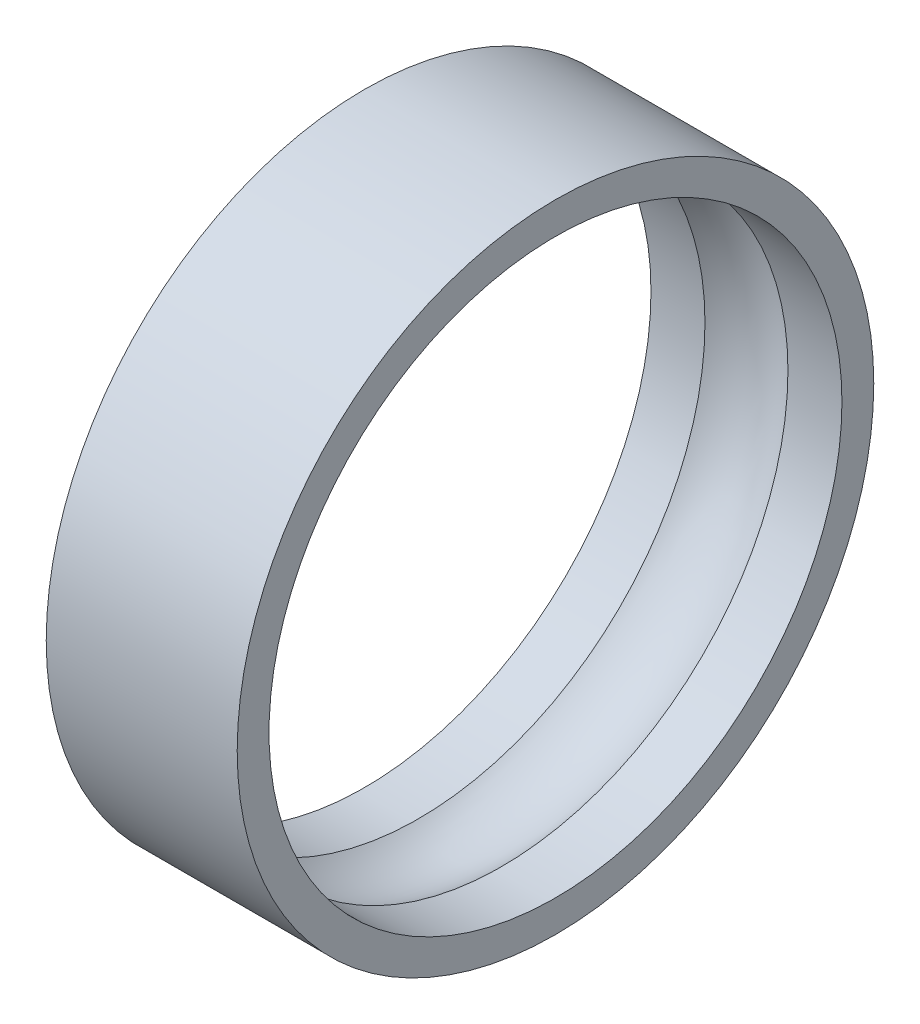
ISO-10303-21;
HEADER;
FILE_DESCRIPTION(('STEP AP214'),'2;1');
FILE_NAME('part.step','',(''),(''),'','','');
FILE_SCHEMA(('AUTOMOTIVE_DESIGN { 1 0 10303 214 1 1 1 1 }'));
ENDSEC;
DATA;
#1=APPLICATION_CONTEXT('core data for automotive mechanical design processes');
#2=APPLICATION_PROTOCOL_DEFINITION('international standard','automotive_design',2000,#1);
#3=PRODUCT_CONTEXT('',#1,'mechanical');
#4=PRODUCT('Part','Part','',(#3));
#5=PRODUCT_RELATED_PRODUCT_CATEGORY('part','',(#4));
#6=PRODUCT_DEFINITION_FORMATION('','',#4);
#7=PRODUCT_DEFINITION_CONTEXT('part definition',#1,'design');
#8=PRODUCT_DEFINITION('design','',#6,#7);
#9=PRODUCT_DEFINITION_SHAPE('','',#8);
#10=(LENGTH_UNIT() NAMED_UNIT(*) SI_UNIT(.MILLI.,.METRE.));
#11=(NAMED_UNIT(*) PLANE_ANGLE_UNIT() SI_UNIT($,.RADIAN.));
#12=(NAMED_UNIT(*) SI_UNIT($,.STERADIAN.) SOLID_ANGLE_UNIT());
#13=UNCERTAINTY_MEASURE_WITH_UNIT(LENGTH_MEASURE(1.E-05),#10,'distance_accuracy_value','');
#14=(GEOMETRIC_REPRESENTATION_CONTEXT(3) GLOBAL_UNCERTAINTY_ASSIGNED_CONTEXT((#13)) GLOBAL_UNIT_ASSIGNED_CONTEXT((#10,
#11,#12)) REPRESENTATION_CONTEXT('',''));
#15=CARTESIAN_POINT('',(0.,0.,0.));
#16=DIRECTION('',(0.,0.,1.));
#17=DIRECTION('',(1.,0.,0.));
#18=AXIS2_PLACEMENT_3D('',#15,#16,#17);
#19=CARTESIAN_POINT('',(0.,-14.25,0.));
#20=DIRECTION('',(1.,0.,0.));
#21=DIRECTION('',(0.,0.,-1.));
#22=AXIS2_PLACEMENT_3D('',#19,#20,#21);
#23=TOROIDAL_SURFACE('',#22,14.3320652805406,4.50000000000017);
#24=CARTESIAN_POINT('',(2.60696277184507,-14.25,0.));
#25=DIRECTION('',(1.,0.,0.));
#26=DIRECTION('',(0.,0.,-1.));
#27=AXIS2_PLACEMENT_3D('',#24,#25,#26);
#28=CIRCLE('',#27,18.);
#29=CARTESIAN_POINT('',(2.60696277184507,-14.25,-18.));
#30=VERTEX_POINT('',#29);
#31=EDGE_CURVE('E10',#30,#30,#28,.T.);
#32=ORIENTED_EDGE('',*,*,#31,.T.);
#33=EDGE_LOOP('',(#32));
#34=FACE_BOUND('',#33,.T.);
#35=CARTESIAN_POINT('',(-2.60696277184507,-14.25,0.));
#36=DIRECTION('',(1.,0.,0.));
#37=DIRECTION('',(0.,0.,-1.));
#38=AXIS2_PLACEMENT_3D('',#35,#36,#37);
#39=CIRCLE('',#38,18.);
#40=CARTESIAN_POINT('',(-2.60696277184507,-14.25,-18.));
#41=VERTEX_POINT('',#40);
#42=EDGE_CURVE('E64',#41,#41,#39,.T.);
#43=ORIENTED_EDGE('',*,*,#42,.F.);
#44=EDGE_LOOP('',(#43));
#45=FACE_BOUND('',#44,.T.);
#46=ADVANCED_FACE('F37',(#34,#45),#23,.F.);
#47=CARTESIAN_POINT('',(21.7151211136297,-14.25,0.));
#48=DIRECTION('',(1.,0.,0.));
#49=DIRECTION('',(0.,0.,-1.));
#50=AXIS2_PLACEMENT_3D('',#47,#48,#49);
#51=CYLINDRICAL_SURFACE('',#50,18.);
#52=CARTESIAN_POINT('',(6.,-14.25,0.));
#53=DIRECTION('',(1.,0.,0.));
#54=DIRECTION('',(0.,0.,-1.));
#55=AXIS2_PLACEMENT_3D('',#52,#53,#54);
#56=CIRCLE('',#55,18.);
#57=CARTESIAN_POINT('',(6.,-14.25,-18.));
#58=VERTEX_POINT('',#57);
#59=EDGE_CURVE('E44',#58,#58,#56,.T.);
#60=ORIENTED_EDGE('',*,*,#59,.T.);
#61=EDGE_LOOP('',(#60));
#62=FACE_BOUND('',#61,.T.);
#63=ORIENTED_EDGE('',*,*,#31,.F.);
#64=EDGE_LOOP('',(#63));
#65=FACE_BOUND('',#64,.T.);
#66=ADVANCED_FACE('F73',(#62,#65),#51,.F.);
#67=CARTESIAN_POINT('',(6.,3.75,0.));
#68=DIRECTION('',(1.,0.,0.));
#69=DIRECTION('',(0.,0.,-1.));
#70=AXIS2_PLACEMENT_3D('',#67,#68,#69);
#71=PLANE('',#70);
#72=CARTESIAN_POINT('',(6.,-14.25,0.));
#73=DIRECTION('',(1.,0.,0.));
#74=DIRECTION('',(0.,0.,-1.));
#75=AXIS2_PLACEMENT_3D('',#72,#73,#74);
#76=CIRCLE('',#75,20.);
#77=CARTESIAN_POINT('',(6.,-14.25,-20.));
#78=VERTEX_POINT('',#77);
#79=EDGE_CURVE('E49',#78,#78,#76,.T.);
#80=ORIENTED_EDGE('',*,*,#79,.T.);
#81=EDGE_LOOP('',(#80));
#82=FACE_BOUND('',#81,.T.);
#83=ORIENTED_EDGE('',*,*,#59,.F.);
#84=EDGE_LOOP('',(#83));
#85=FACE_BOUND('',#84,.T.);
#86=ADVANCED_FACE('F77',(#82,#85),#71,.T.);
#87=CARTESIAN_POINT('',(21.7151211136297,-14.25,0.));
#88=DIRECTION('',(1.,0.,0.));
#89=DIRECTION('',(0.,0.,-1.));
#90=AXIS2_PLACEMENT_3D('',#87,#88,#89);
#91=CYLINDRICAL_SURFACE('',#90,20.);
#92=CARTESIAN_POINT('',(-6.,-14.25,0.));
#93=DIRECTION('',(1.,0.,0.));
#94=DIRECTION('',(0.,0.,-1.));
#95=AXIS2_PLACEMENT_3D('',#92,#93,#94);
#96=CIRCLE('',#95,20.);
#97=CARTESIAN_POINT('',(-6.,-14.25,-20.));
#98=VERTEX_POINT('',#97);
#99=EDGE_CURVE('E54',#98,#98,#96,.T.);
#100=ORIENTED_EDGE('',*,*,#99,.T.);
#101=EDGE_LOOP('',(#100));
#102=FACE_BOUND('',#101,.T.);
#103=ORIENTED_EDGE('',*,*,#79,.F.);
#104=EDGE_LOOP('',(#103));
#105=FACE_BOUND('',#104,.T.);
#106=ADVANCED_FACE('F81',(#102,#105),#91,.T.);
#107=CARTESIAN_POINT('',(-6.,3.75,0.));
#108=DIRECTION('',(-1.,0.,0.));
#109=DIRECTION('',(0.,0.,1.));
#110=AXIS2_PLACEMENT_3D('',#107,#108,#109);
#111=PLANE('',#110);
#112=CARTESIAN_POINT('',(-6.,-14.25,0.));
#113=DIRECTION('',(1.,0.,0.));
#114=DIRECTION('',(0.,0.,-1.));
#115=AXIS2_PLACEMENT_3D('',#112,#113,#114);
#116=CIRCLE('',#115,18.);
#117=CARTESIAN_POINT('',(-6.,-14.25,-18.));
#118=VERTEX_POINT('',#117);
#119=EDGE_CURVE('E60',#118,#118,#116,.T.);
#120=ORIENTED_EDGE('',*,*,#119,.T.);
#121=EDGE_LOOP('',(#120));
#122=FACE_BOUND('',#121,.T.);
#123=ORIENTED_EDGE('',*,*,#99,.F.);
#124=EDGE_LOOP('',(#123));
#125=FACE_BOUND('',#124,.T.);
#126=ADVANCED_FACE('F88',(#122,#125),#111,.T.);
#127=CARTESIAN_POINT('',(21.7151211136297,-14.25,0.));
#128=DIRECTION('',(1.,0.,0.));
#129=DIRECTION('',(0.,0.,-1.));
#130=AXIS2_PLACEMENT_3D('',#127,#128,#129);
#131=CYLINDRICAL_SURFACE('',#130,18.);
#132=ORIENTED_EDGE('',*,*,#42,.T.);
#133=EDGE_LOOP('',(#132));
#134=FACE_BOUND('',#133,.T.);
#135=ORIENTED_EDGE('',*,*,#119,.F.);
#136=EDGE_LOOP('',(#135));
#137=FACE_BOUND('',#136,.T.);
#138=ADVANCED_FACE('F69',(#134,#137),#131,.F.);
#139=CLOSED_SHELL('',(#46,#66,#86,#106,#126,#138));
#140=MANIFOLD_SOLID_BREP('B2',#139);
#141=ADVANCED_BREP_SHAPE_REPRESENTATION('',(#18,#140),#14);
#142=SHAPE_DEFINITION_REPRESENTATION(#9,#141);
ENDSEC;
END-ISO-10303-21;
